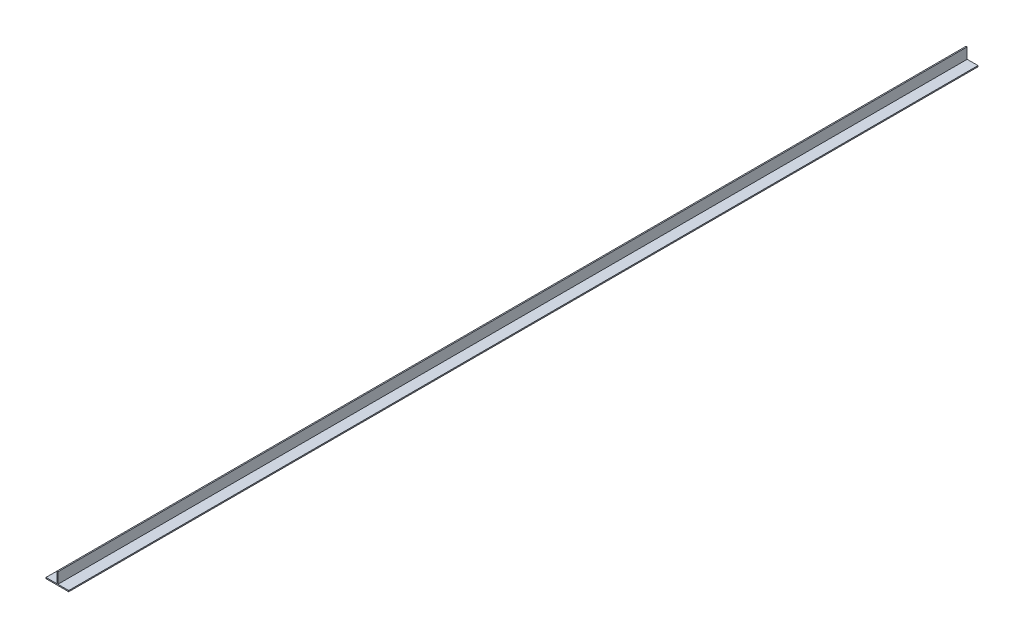
ISO-10303-21;
HEADER;
FILE_DESCRIPTION(('STEP AP214'),'2;1');
FILE_NAME('part.step','',(''),(''),'','','');
FILE_SCHEMA(('AUTOMOTIVE_DESIGN { 1 0 10303 214 1 1 1 1 }'));
ENDSEC;
DATA;
#1=APPLICATION_CONTEXT('core data for automotive mechanical design processes');
#2=APPLICATION_PROTOCOL_DEFINITION('international standard','automotive_design',2000,#1);
#3=PRODUCT_CONTEXT('',#1,'mechanical');
#4=PRODUCT('Part','Part','',(#3));
#5=PRODUCT_RELATED_PRODUCT_CATEGORY('part','',(#4));
#6=PRODUCT_DEFINITION_FORMATION('','',#4);
#7=PRODUCT_DEFINITION_CONTEXT('part definition',#1,'design');
#8=PRODUCT_DEFINITION('design','',#6,#7);
#9=PRODUCT_DEFINITION_SHAPE('','',#8);
#10=(LENGTH_UNIT() NAMED_UNIT(*) SI_UNIT(.MILLI.,.METRE.));
#11=(NAMED_UNIT(*) PLANE_ANGLE_UNIT() SI_UNIT($,.RADIAN.));
#12=(NAMED_UNIT(*) SI_UNIT($,.STERADIAN.) SOLID_ANGLE_UNIT());
#13=UNCERTAINTY_MEASURE_WITH_UNIT(LENGTH_MEASURE(1.E-05),#10,'distance_accuracy_value','');
#14=(GEOMETRIC_REPRESENTATION_CONTEXT(3) GLOBAL_UNCERTAINTY_ASSIGNED_CONTEXT((#13)) GLOBAL_UNIT_ASSIGNED_CONTEXT((#10,
#11,#12)) REPRESENTATION_CONTEXT('',''));
#15=CARTESIAN_POINT('',(0.,0.,0.));
#16=DIRECTION('',(0.,0.,1.));
#17=DIRECTION('',(1.,0.,0.));
#18=AXIS2_PLACEMENT_3D('',#15,#16,#17);
#19=CARTESIAN_POINT('',(10.,0.,400.));
#20=DIRECTION('',(-1.,0.,0.));
#21=DIRECTION('',(0.,0.,1.));
#22=AXIS2_PLACEMENT_3D('',#19,#20,#21);
#23=PLANE('',#22);
#24=DIRECTION('',(0.,1.,0.));
#25=VECTOR('',#24,1.);
#26=CARTESIAN_POINT('',(10.,0.,-400.));
#27=LINE('',#26,#25);
#28=CARTESIAN_POINT('',(10.,-1.,-400.));
#29=VERTEX_POINT('',#28);
#30=CARTESIAN_POINT('',(10.,0.,-400.));
#31=VERTEX_POINT('',#30);
#32=EDGE_CURVE('E129',#29,#31,#27,.T.);
#33=ORIENTED_EDGE('',*,*,#32,.T.);
#34=DIRECTION('',(0.,0.,-1.));
#35=VECTOR('',#34,1.);
#36=CARTESIAN_POINT('',(10.,0.,400.));
#37=LINE('',#36,#35);
#38=CARTESIAN_POINT('',(10.,0.,400.));
#39=VERTEX_POINT('',#38);
#40=EDGE_CURVE('E11',#39,#31,#37,.T.);
#41=ORIENTED_EDGE('',*,*,#40,.F.);
#42=DIRECTION('',(0.,1.,0.));
#43=VECTOR('',#42,1.);
#44=CARTESIAN_POINT('',(10.,0.,400.));
#45=LINE('',#44,#43);
#46=CARTESIAN_POINT('',(10.,-1.,400.));
#47=VERTEX_POINT('',#46);
#48=EDGE_CURVE('E143',#47,#39,#45,.T.);
#49=ORIENTED_EDGE('',*,*,#48,.F.);
#50=DIRECTION('',(0.,0.,-1.));
#51=VECTOR('',#50,1.);
#52=CARTESIAN_POINT('',(10.,-1.,400.));
#53=LINE('',#52,#51);
#54=EDGE_CURVE('E125',#47,#29,#53,.T.);
#55=ORIENTED_EDGE('',*,*,#54,.T.);
#56=EDGE_LOOP('',(#33,#41,#49,#55));
#57=FACE_BOUND('',#56,.T.);
#58=ADVANCED_FACE('F33',(#57),#23,.F.);
#59=CARTESIAN_POINT('',(0.500000000000002,0.,400.));
#60=DIRECTION('',(0.,-1.,0.));
#61=DIRECTION('',(1.,0.,0.));
#62=AXIS2_PLACEMENT_3D('',#59,#60,#61);
#63=PLANE('',#62);
#64=DIRECTION('',(-1.,0.,0.));
#65=VECTOR('',#64,1.);
#66=CARTESIAN_POINT('',(0.500000000000002,0.,-400.));
#67=LINE('',#66,#65);
#68=CARTESIAN_POINT('',(0.500000000000002,0.,-400.));
#69=VERTEX_POINT('',#68);
#70=EDGE_CURVE('E132',#31,#69,#67,.T.);
#71=ORIENTED_EDGE('',*,*,#70,.T.);
#72=DIRECTION('',(0.,0.,-1.));
#73=VECTOR('',#72,1.);
#74=CARTESIAN_POINT('',(0.500000000000002,0.,400.));
#75=LINE('',#74,#73);
#76=CARTESIAN_POINT('',(0.500000000000002,0.,400.));
#77=VERTEX_POINT('',#76);
#78=EDGE_CURVE('E41',#77,#69,#75,.T.);
#79=ORIENTED_EDGE('',*,*,#78,.F.);
#80=DIRECTION('',(-1.,0.,0.));
#81=VECTOR('',#80,1.);
#82=CARTESIAN_POINT('',(0.500000000000002,0.,400.));
#83=LINE('',#82,#81);
#84=EDGE_CURVE('E92',#39,#77,#83,.T.);
#85=ORIENTED_EDGE('',*,*,#84,.F.);
#86=ORIENTED_EDGE('',*,*,#40,.T.);
#87=EDGE_LOOP('',(#71,#79,#85,#86));
#88=FACE_BOUND('',#87,.T.);
#89=ADVANCED_FACE('F178',(#88),#63,.F.);
#90=CARTESIAN_POINT('',(0.500000000000002,0.,400.));
#91=DIRECTION('',(-1.,0.,0.));
#92=DIRECTION('',(0.,-1.,0.));
#93=AXIS2_PLACEMENT_3D('',#90,#91,#92);
#94=PLANE('',#93);
#95=DIRECTION('',(0.,1.,0.));
#96=VECTOR('',#95,1.);
#97=CARTESIAN_POINT('',(0.500000000000002,0.,-400.));
#98=LINE('',#97,#96);
#99=CARTESIAN_POINT('',(0.499999999999997,9.5,-400.));
#100=VERTEX_POINT('',#99);
#101=EDGE_CURVE('E134',#69,#100,#98,.T.);
#102=ORIENTED_EDGE('',*,*,#101,.T.);
#103=DIRECTION('',(0.,0.,-1.));
#104=VECTOR('',#103,1.);
#105=CARTESIAN_POINT('',(0.499999999999997,9.5,400.));
#106=LINE('',#105,#104);
#107=CARTESIAN_POINT('',(0.499999999999997,9.5,400.));
#108=VERTEX_POINT('',#107);
#109=EDGE_CURVE('E150',#108,#100,#106,.T.);
#110=ORIENTED_EDGE('',*,*,#109,.F.);
#111=DIRECTION('',(0.,1.,0.));
#112=VECTOR('',#111,1.);
#113=CARTESIAN_POINT('',(0.500000000000002,0.,400.));
#114=LINE('',#113,#112);
#115=EDGE_CURVE('E158',#77,#108,#114,.T.);
#116=ORIENTED_EDGE('',*,*,#115,.F.);
#117=ORIENTED_EDGE('',*,*,#78,.T.);
#118=EDGE_LOOP('',(#102,#110,#116,#117));
#119=FACE_BOUND('',#118,.T.);
#120=ADVANCED_FACE('F156',(#119),#94,.F.);
#121=CARTESIAN_POINT('',(-0.500000000000002,9.5,400.));
#122=DIRECTION('',(0.,-1.,0.));
#123=DIRECTION('',(0.,0.,-1.));
#124=AXIS2_PLACEMENT_3D('',#121,#122,#123);
#125=PLANE('',#124);
#126=DIRECTION('',(-1.,0.,0.));
#127=VECTOR('',#126,1.);
#128=CARTESIAN_POINT('',(-0.500000000000002,9.5,-400.));
#129=LINE('',#128,#127);
#130=CARTESIAN_POINT('',(-0.500000000000002,9.5,-400.));
#131=VERTEX_POINT('',#130);
#132=EDGE_CURVE('E136',#100,#131,#129,.T.);
#133=ORIENTED_EDGE('',*,*,#132,.T.);
#134=DIRECTION('',(0.,0.,-1.));
#135=VECTOR('',#134,1.);
#136=CARTESIAN_POINT('',(-0.500000000000002,9.5,400.));
#137=LINE('',#136,#135);
#138=CARTESIAN_POINT('',(-0.500000000000002,9.5,400.));
#139=VERTEX_POINT('',#138);
#140=EDGE_CURVE('E147',#139,#131,#137,.T.);
#141=ORIENTED_EDGE('',*,*,#140,.F.);
#142=DIRECTION('',(-1.,0.,0.));
#143=VECTOR('',#142,1.);
#144=CARTESIAN_POINT('',(-0.500000000000002,9.5,400.));
#145=LINE('',#144,#143);
#146=EDGE_CURVE('E170',#108,#139,#145,.T.);
#147=ORIENTED_EDGE('',*,*,#146,.F.);
#148=ORIENTED_EDGE('',*,*,#109,.T.);
#149=EDGE_LOOP('',(#133,#141,#147,#148));
#150=FACE_BOUND('',#149,.T.);
#151=ADVANCED_FACE('F166',(#150),#125,.F.);
#152=CARTESIAN_POINT('',(-0.5,0.,400.));
#153=DIRECTION('',(1.,0.,0.));
#154=DIRECTION('',(0.,1.,0.));
#155=AXIS2_PLACEMENT_3D('',#152,#153,#154);
#156=PLANE('',#155);
#157=DIRECTION('',(0.,-1.,0.));
#158=VECTOR('',#157,1.);
#159=CARTESIAN_POINT('',(-0.5,0.,-400.));
#160=LINE('',#159,#158);
#161=CARTESIAN_POINT('',(-0.5,0.,-400.));
#162=VERTEX_POINT('',#161);
#163=EDGE_CURVE('E138',#131,#162,#160,.T.);
#164=ORIENTED_EDGE('',*,*,#163,.T.);
#165=DIRECTION('',(0.,0.,-1.));
#166=VECTOR('',#165,1.);
#167=CARTESIAN_POINT('',(-0.5,0.,400.));
#168=LINE('',#167,#166);
#169=CARTESIAN_POINT('',(-0.5,0.,400.));
#170=VERTEX_POINT('',#169);
#171=EDGE_CURVE('E120',#170,#162,#168,.T.);
#172=ORIENTED_EDGE('',*,*,#171,.F.);
#173=DIRECTION('',(0.,-1.,0.));
#174=VECTOR('',#173,1.);
#175=CARTESIAN_POINT('',(-0.5,0.,400.));
#176=LINE('',#175,#174);
#177=EDGE_CURVE('E111',#139,#170,#176,.T.);
#178=ORIENTED_EDGE('',*,*,#177,.F.);
#179=ORIENTED_EDGE('',*,*,#140,.T.);
#180=EDGE_LOOP('',(#164,#172,#178,#179));
#181=FACE_BOUND('',#180,.T.);
#182=ADVANCED_FACE('F169',(#181),#156,.F.);
#183=CARTESIAN_POINT('',(-10.,0.,400.));
#184=DIRECTION('',(0.,-1.,0.));
#185=DIRECTION('',(0.,0.,-1.));
#186=AXIS2_PLACEMENT_3D('',#183,#184,#185);
#187=PLANE('',#186);
#188=DIRECTION('',(-1.,0.,0.));
#189=VECTOR('',#188,1.);
#190=CARTESIAN_POINT('',(-10.,0.,-400.));
#191=LINE('',#190,#189);
#192=CARTESIAN_POINT('',(-10.,0.,-400.));
#193=VERTEX_POINT('',#192);
#194=EDGE_CURVE('E119',#162,#193,#191,.T.);
#195=ORIENTED_EDGE('',*,*,#194,.T.);
#196=DIRECTION('',(0.,0.,-1.));
#197=VECTOR('',#196,1.);
#198=CARTESIAN_POINT('',(-10.,0.,400.));
#199=LINE('',#198,#197);
#200=CARTESIAN_POINT('',(-10.,0.,400.));
#201=VERTEX_POINT('',#200);
#202=EDGE_CURVE('E116',#201,#193,#199,.T.);
#203=ORIENTED_EDGE('',*,*,#202,.F.);
#204=DIRECTION('',(-1.,0.,0.));
#205=VECTOR('',#204,1.);
#206=CARTESIAN_POINT('',(-10.,0.,400.));
#207=LINE('',#206,#205);
#208=EDGE_CURVE('E105',#170,#201,#207,.T.);
#209=ORIENTED_EDGE('',*,*,#208,.F.);
#210=ORIENTED_EDGE('',*,*,#171,.T.);
#211=EDGE_LOOP('',(#195,#203,#209,#210));
#212=FACE_BOUND('',#211,.T.);
#213=ADVANCED_FACE('F117',(#212),#187,.F.);
#214=CARTESIAN_POINT('',(-10.,0.,400.));
#215=DIRECTION('',(1.,0.,0.));
#216=DIRECTION('',(0.,0.,-1.));
#217=AXIS2_PLACEMENT_3D('',#214,#215,#216);
#218=PLANE('',#217);
#219=DIRECTION('',(0.,-1.,0.));
#220=VECTOR('',#219,1.);
#221=CARTESIAN_POINT('',(-10.,0.,-400.));
#222=LINE('',#221,#220);
#223=CARTESIAN_POINT('',(-10.,-1.,-400.));
#224=VERTEX_POINT('',#223);
#225=EDGE_CURVE('E78',#193,#224,#222,.T.);
#226=ORIENTED_EDGE('',*,*,#225,.T.);
#227=DIRECTION('',(0.,0.,-1.));
#228=VECTOR('',#227,1.);
#229=CARTESIAN_POINT('',(-10.,-1.,400.));
#230=LINE('',#229,#228);
#231=CARTESIAN_POINT('',(-10.,-1.,400.));
#232=VERTEX_POINT('',#231);
#233=EDGE_CURVE('E121',#232,#224,#230,.T.);
#234=ORIENTED_EDGE('',*,*,#233,.F.);
#235=DIRECTION('',(0.,-1.,0.));
#236=VECTOR('',#235,1.);
#237=CARTESIAN_POINT('',(-10.,0.,400.));
#238=LINE('',#237,#236);
#239=EDGE_CURVE('E109',#201,#232,#238,.T.);
#240=ORIENTED_EDGE('',*,*,#239,.F.);
#241=ORIENTED_EDGE('',*,*,#202,.T.);
#242=EDGE_LOOP('',(#226,#234,#240,#241));
#243=FACE_BOUND('',#242,.T.);
#244=ADVANCED_FACE('F123',(#243),#218,.F.);
#245=CARTESIAN_POINT('',(-10.,-1.,400.));
#246=DIRECTION('',(0.,1.,0.));
#247=DIRECTION('',(0.,0.,1.));
#248=AXIS2_PLACEMENT_3D('',#245,#246,#247);
#249=PLANE('',#248);
#250=DIRECTION('',(1.,0.,0.));
#251=VECTOR('',#250,1.);
#252=CARTESIAN_POINT('',(-10.,-1.,-400.));
#253=LINE('',#252,#251);
#254=EDGE_CURVE('E84',#224,#29,#253,.T.);
#255=ORIENTED_EDGE('',*,*,#254,.T.);
#256=ORIENTED_EDGE('',*,*,#54,.F.);
#257=DIRECTION('',(1.,0.,0.));
#258=VECTOR('',#257,1.);
#259=CARTESIAN_POINT('',(-10.,-1.,400.));
#260=LINE('',#259,#258);
#261=EDGE_CURVE('E49',#232,#47,#260,.T.);
#262=ORIENTED_EDGE('',*,*,#261,.F.);
#263=ORIENTED_EDGE('',*,*,#233,.T.);
#264=EDGE_LOOP('',(#255,#256,#262,#263));
#265=FACE_BOUND('',#264,.T.);
#266=ADVANCED_FACE('F194',(#265),#249,.F.);
#267=CARTESIAN_POINT('',(0.,0.,400.));
#268=DIRECTION('',(0.,0.,1.));
#269=DIRECTION('',(1.,0.,0.));
#270=AXIS2_PLACEMENT_3D('',#267,#268,#269);
#271=PLANE('',#270);
#272=ORIENTED_EDGE('',*,*,#48,.T.);
#273=ORIENTED_EDGE('',*,*,#84,.T.);
#274=ORIENTED_EDGE('',*,*,#115,.T.);
#275=ORIENTED_EDGE('',*,*,#146,.T.);
#276=ORIENTED_EDGE('',*,*,#177,.T.);
#277=ORIENTED_EDGE('',*,*,#208,.T.);
#278=ORIENTED_EDGE('',*,*,#239,.T.);
#279=ORIENTED_EDGE('',*,*,#261,.T.);
#280=EDGE_LOOP('',(#272,#273,#274,#275,#276,#277,#278,#279));
#281=FACE_BOUND('',#280,.T.);
#282=ADVANCED_FACE('F107',(#281),#271,.T.);
#283=CARTESIAN_POINT('',(0.,0.,-400.));
#284=DIRECTION('',(0.,0.,1.));
#285=DIRECTION('',(1.,0.,0.));
#286=AXIS2_PLACEMENT_3D('',#283,#284,#285);
#287=PLANE('',#286);
#288=ORIENTED_EDGE('',*,*,#32,.F.);
#289=ORIENTED_EDGE('',*,*,#254,.F.);
#290=ORIENTED_EDGE('',*,*,#225,.F.);
#291=ORIENTED_EDGE('',*,*,#194,.F.);
#292=ORIENTED_EDGE('',*,*,#163,.F.);
#293=ORIENTED_EDGE('',*,*,#132,.F.);
#294=ORIENTED_EDGE('',*,*,#101,.F.);
#295=ORIENTED_EDGE('',*,*,#70,.F.);
#296=EDGE_LOOP('',(#288,#289,#290,#291,#292,#293,#294,#295));
#297=FACE_BOUND('',#296,.T.);
#298=ADVANCED_FACE('F162',(#297),#287,.F.);
#299=CLOSED_SHELL('',(#58,#89,#120,#151,#182,#213,#244,#266,#282,#298));
#300=MANIFOLD_SOLID_BREP('B2',#299);
#301=ADVANCED_BREP_SHAPE_REPRESENTATION('',(#18,#300),#14);
#302=SHAPE_DEFINITION_REPRESENTATION(#9,#301);
ENDSEC;
END-ISO-10303-21;
